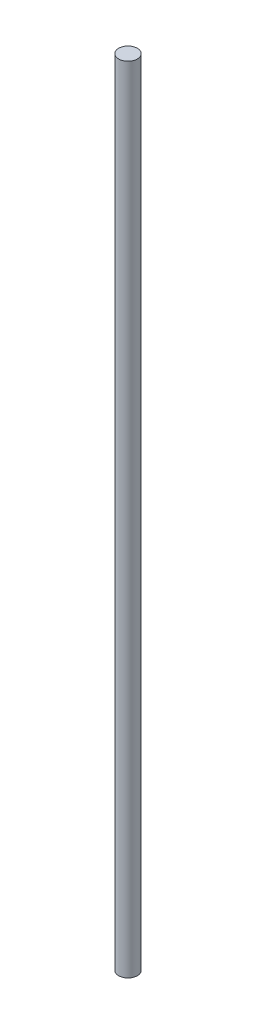
ISO-10303-21;
HEADER;
FILE_DESCRIPTION(('STEP AP214'),'2;1');
FILE_NAME('part.step','',(''),(''),'','','');
FILE_SCHEMA(('AUTOMOTIVE_DESIGN { 1 0 10303 214 1 1 1 1 }'));
ENDSEC;
DATA;
#1=APPLICATION_CONTEXT('core data for automotive mechanical design processes');
#2=APPLICATION_PROTOCOL_DEFINITION('international standard','automotive_design',2000,#1);
#3=PRODUCT_CONTEXT('',#1,'mechanical');
#4=PRODUCT('Part','Part','',(#3));
#5=PRODUCT_RELATED_PRODUCT_CATEGORY('part','',(#4));
#6=PRODUCT_DEFINITION_FORMATION('','',#4);
#7=PRODUCT_DEFINITION_CONTEXT('part definition',#1,'design');
#8=PRODUCT_DEFINITION('design','',#6,#7);
#9=PRODUCT_DEFINITION_SHAPE('','',#8);
#10=(LENGTH_UNIT() NAMED_UNIT(*) SI_UNIT(.MILLI.,.METRE.));
#11=(NAMED_UNIT(*) PLANE_ANGLE_UNIT() SI_UNIT($,.RADIAN.));
#12=(NAMED_UNIT(*) SI_UNIT($,.STERADIAN.) SOLID_ANGLE_UNIT());
#13=UNCERTAINTY_MEASURE_WITH_UNIT(LENGTH_MEASURE(1.E-05),#10,'distance_accuracy_value','');
#14=(GEOMETRIC_REPRESENTATION_CONTEXT(3) GLOBAL_UNCERTAINTY_ASSIGNED_CONTEXT((#13)) GLOBAL_UNIT_ASSIGNED_CONTEXT((#10,
#11,#12)) REPRESENTATION_CONTEXT('',''));
#15=CARTESIAN_POINT('',(0.,0.,0.));
#16=DIRECTION('',(0.,0.,1.));
#17=DIRECTION('',(1.,0.,0.));
#18=AXIS2_PLACEMENT_3D('',#15,#16,#17);
#19=CARTESIAN_POINT('',(0.,540.,0.));
#20=DIRECTION('',(0.,-1.,0.));
#21=DIRECTION('',(0.,0.,-1.));
#22=AXIS2_PLACEMENT_3D('',#19,#20,#21);
#23=CYLINDRICAL_SURFACE('',#22,6.35);
#24=CARTESIAN_POINT('',(0.,540.,0.));
#25=DIRECTION('',(0.,1.,0.));
#26=DIRECTION('',(0.,0.,1.));
#27=AXIS2_PLACEMENT_3D('',#24,#25,#26);
#28=CIRCLE('',#27,6.35);
#29=CARTESIAN_POINT('',(0.,540.,6.35));
#30=VERTEX_POINT('',#29);
#31=EDGE_CURVE('E10',#30,#30,#28,.T.);
#32=ORIENTED_EDGE('',*,*,#31,.F.);
#33=EDGE_LOOP('',(#32));
#34=FACE_BOUND('',#33,.T.);
#35=CARTESIAN_POINT('',(0.,0.,0.));
#36=DIRECTION('',(0.,1.,0.));
#37=DIRECTION('',(0.,0.,1.));
#38=AXIS2_PLACEMENT_3D('',#35,#36,#37);
#39=CIRCLE('',#38,6.35);
#40=CARTESIAN_POINT('',(0.,0.,6.35));
#41=VERTEX_POINT('',#40);
#42=EDGE_CURVE('E34',#41,#41,#39,.T.);
#43=ORIENTED_EDGE('',*,*,#42,.T.);
#44=EDGE_LOOP('',(#43));
#45=FACE_BOUND('',#44,.T.);
#46=ADVANCED_FACE('F31',(#34,#45),#23,.T.);
#47=CARTESIAN_POINT('',(0.,540.,0.));
#48=DIRECTION('',(0.,1.,0.));
#49=DIRECTION('',(0.,0.,1.));
#50=AXIS2_PLACEMENT_3D('',#47,#48,#49);
#51=PLANE('',#50);
#52=ORIENTED_EDGE('',*,*,#31,.T.);
#53=EDGE_LOOP('',(#52));
#54=FACE_BOUND('',#53,.T.);
#55=ADVANCED_FACE('F46',(#54),#51,.T.);
#56=CARTESIAN_POINT('',(0.,0.,0.));
#57=DIRECTION('',(0.,1.,0.));
#58=DIRECTION('',(0.,0.,1.));
#59=AXIS2_PLACEMENT_3D('',#56,#57,#58);
#60=PLANE('',#59);
#61=ORIENTED_EDGE('',*,*,#42,.F.);
#62=EDGE_LOOP('',(#61));
#63=FACE_BOUND('',#62,.T.);
#64=ADVANCED_FACE('F44',(#63),#60,.F.);
#65=CLOSED_SHELL('',(#46,#55,#64));
#66=MANIFOLD_SOLID_BREP('B2',#65);
#67=ADVANCED_BREP_SHAPE_REPRESENTATION('',(#18,#66),#14);
#68=SHAPE_DEFINITION_REPRESENTATION(#9,#67);
ENDSEC;
END-ISO-10303-21;
